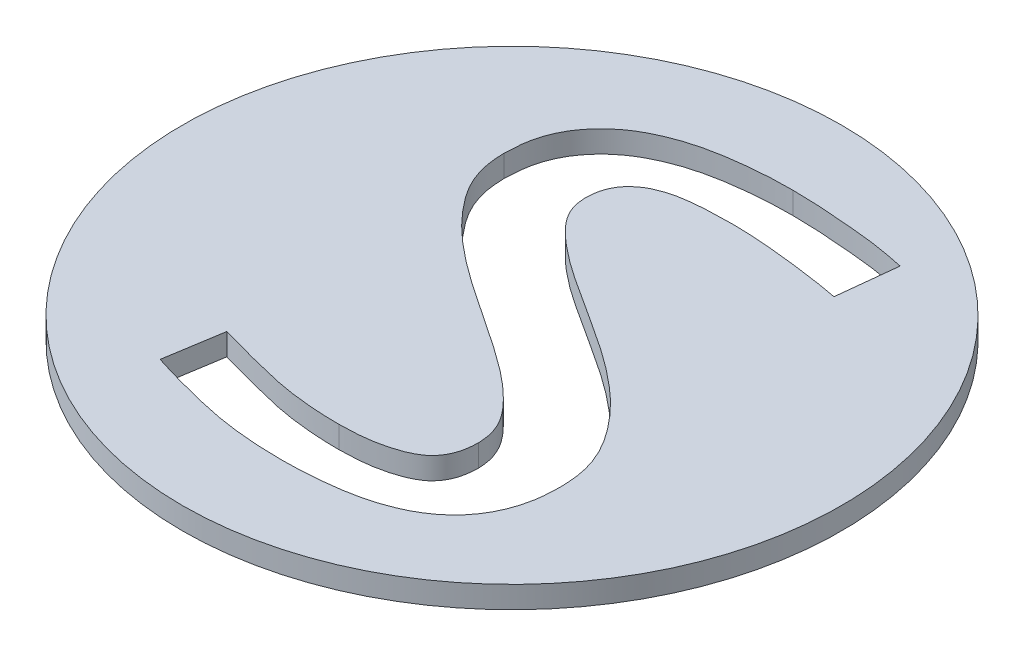
ISO-10303-21;
HEADER;
FILE_DESCRIPTION(('STEP AP214'),'2;1');
FILE_NAME('part.step','',(''),(''),'','','');
FILE_SCHEMA(('AUTOMOTIVE_DESIGN { 1 0 10303 214 1 1 1 1 }'));
ENDSEC;
DATA;
#1=APPLICATION_CONTEXT('core data for automotive mechanical design processes');
#2=APPLICATION_PROTOCOL_DEFINITION('international standard','automotive_design',2000,#1);
#3=PRODUCT_CONTEXT('',#1,'mechanical');
#4=PRODUCT('Part','Part','',(#3));
#5=PRODUCT_RELATED_PRODUCT_CATEGORY('part','',(#4));
#6=PRODUCT_DEFINITION_FORMATION('','',#4);
#7=PRODUCT_DEFINITION_CONTEXT('part definition',#1,'design');
#8=PRODUCT_DEFINITION('design','',#6,#7);
#9=PRODUCT_DEFINITION_SHAPE('','',#8);
#10=(LENGTH_UNIT() NAMED_UNIT(*) SI_UNIT(.MILLI.,.METRE.));
#11=(NAMED_UNIT(*) PLANE_ANGLE_UNIT() SI_UNIT($,.RADIAN.));
#12=(NAMED_UNIT(*) SI_UNIT($,.STERADIAN.) SOLID_ANGLE_UNIT());
#13=UNCERTAINTY_MEASURE_WITH_UNIT(LENGTH_MEASURE(1.E-05),#10,'distance_accuracy_value','');
#14=(GEOMETRIC_REPRESENTATION_CONTEXT(3) GLOBAL_UNCERTAINTY_ASSIGNED_CONTEXT((#13)) GLOBAL_UNIT_ASSIGNED_CONTEXT((#10,
#11,#12)) REPRESENTATION_CONTEXT('',''));
#15=CARTESIAN_POINT('',(0.,0.,0.));
#16=DIRECTION('',(0.,0.,1.));
#17=DIRECTION('',(1.,0.,0.));
#18=AXIS2_PLACEMENT_3D('',#15,#16,#17);
#19=CARTESIAN_POINT('',(0.,3.,0.));
#20=DIRECTION('',(0.,-1.,0.));
#21=DIRECTION('',(0.,0.,-1.));
#22=AXIS2_PLACEMENT_3D('',#19,#20,#21);
#23=CYLINDRICAL_SURFACE('',#22,45.);
#24=CARTESIAN_POINT('',(0.,3.,0.));
#25=DIRECTION('',(0.,1.,0.));
#26=DIRECTION('',(0.,0.,1.));
#27=AXIS2_PLACEMENT_3D('',#24,#25,#26);
#28=CIRCLE('',#27,45.);
#29=CARTESIAN_POINT('',(0.,3.,45.));
#30=VERTEX_POINT('',#29);
#31=EDGE_CURVE('E11',#30,#30,#28,.T.);
#32=ORIENTED_EDGE('',*,*,#31,.F.);
#33=EDGE_LOOP('',(#32));
#34=FACE_BOUND('',#33,.T.);
#35=CARTESIAN_POINT('',(0.,0.,0.));
#36=DIRECTION('',(0.,1.,0.));
#37=DIRECTION('',(0.,0.,1.));
#38=AXIS2_PLACEMENT_3D('',#35,#36,#37);
#39=CIRCLE('',#38,45.);
#40=CARTESIAN_POINT('',(0.,0.,45.));
#41=VERTEX_POINT('',#40);
#42=EDGE_CURVE('E36',#41,#41,#39,.T.);
#43=ORIENTED_EDGE('',*,*,#42,.T.);
#44=EDGE_LOOP('',(#43));
#45=FACE_BOUND('',#44,.T.);
#46=ADVANCED_FACE('F33',(#34,#45),#23,.T.);
#47=CARTESIAN_POINT('',(0.,3.,0.));
#48=DIRECTION('',(0.,1.,0.));
#49=DIRECTION('',(0.,0.,1.));
#50=AXIS2_PLACEMENT_3D('',#47,#48,#49);
#51=PLANE('',#50);
#52=DIRECTION('',(-0.108540378836708,0.,0.994092041091761));
#53=VECTOR('',#52,1.);
#54=CARTESIAN_POINT('',(20.6696628205624,3.,-32.3242306669531));
#55=LINE('',#54,#53);
#56=CARTESIAN_POINT('',(20.6696628205624,3.,-32.3242306669531));
#57=VERTEX_POINT('',#56);
#58=CARTESIAN_POINT('',(19.7809909455624,3.,-24.1851247641753));
#59=VERTEX_POINT('',#58);
#60=EDGE_CURVE('E123',#57,#59,#55,.T.);
#61=ORIENTED_EDGE('',*,*,#60,.T.);
#62=CARTESIAN_POINT('',(19.7809909455624,3.,-24.1851247641753));
#63=CARTESIAN_POINT('',(19.255065106621,3.,-24.2879147975227));
#64=CARTESIAN_POINT('',(18.1220863050278,3.,-24.5093508255225));
#65=CARTESIAN_POINT('',(16.3165516273251,3.,-24.7701799570665));
#66=CARTESIAN_POINT('',(14.3577524177518,3.,-25.0573301276036));
#67=CARTESIAN_POINT('',(12.3110582965966,3.,-25.3028329725789));
#68=CARTESIAN_POINT('',(10.2295676081157,3.,-25.5379302434009));
#69=CARTESIAN_POINT('',(8.17330110133087,3.,-25.6960778815114));
#70=CARTESIAN_POINT('',(6.22191350872532,3.,-25.8192665571809));
#71=CARTESIAN_POINT('',(4.96995689520007,3.,-25.839869106277));
#72=CARTESIAN_POINT('',(4.37734511222905,3.,-25.8496212919531));
#73=B_SPLINE_CURVE_WITH_KNOTS('',3,(#62,#63,#64,#65,#66,#67,#68,#69,#70,#71,#72),.UNSPECIFIED.,
.F.,.F.,(4,1,1,1,1,1,1,1,4),(0.,0.103629530367887,0.223244519345558,0.352755691955491,
0.486535688759644,0.621913482174517,0.757855193409768,0.885381119425096,1.),.UNSPECIFIED.);
#74=CARTESIAN_POINT('',(4.37734511222905,3.,-25.8496212919531));
#75=VERTEX_POINT('',#74);
#76=EDGE_CURVE('E132',#59,#75,#73,.T.);
#77=ORIENTED_EDGE('',*,*,#76,.T.);
#78=CARTESIAN_POINT('',(4.37734511222905,3.,-25.8496212919531));
#79=CARTESIAN_POINT('',(3.44620414552795,3.,-25.839565027623));
#80=CARTESIAN_POINT('',(1.65716033962061,3.,-25.8202434661691));
#81=CARTESIAN_POINT('',(-0.523497458604941,3.,-25.6784224058074));
#82=CARTESIAN_POINT('',(-2.13481450245812,3.,-25.4666213631972));
#83=CARTESIAN_POINT('',(-3.23425872256685,3.,-25.2697433744932));
#84=CARTESIAN_POINT('',(-4.23972254664861,3.,-24.9640518496958));
#85=CARTESIAN_POINT('',(-5.16308949744127,3.,-24.6149936573541));
#86=CARTESIAN_POINT('',(-6.00243157466114,3.,-24.2016604889534));
#87=CARTESIAN_POINT('',(-6.7335068284394,3.,-23.6758956633615));
#88=CARTESIAN_POINT('',(-7.38314189752563,3.,-23.0929977964632));
#89=CARTESIAN_POINT('',(-7.93008105238181,3.,-22.4195432787736));
#90=CARTESIAN_POINT('',(-8.35993509112979,3.,-21.6573677988957));
#91=CARTESIAN_POINT('',(-8.67379089911849,3.,-20.7965887840227));
#92=CARTESIAN_POINT('',(-8.85601585500777,3.,-19.8293573641394));
#93=CARTESIAN_POINT('',(-8.87324058085876,3.,-19.1501149514904));
#94=CARTESIAN_POINT('',(-8.88220349888207,3.,-18.7966699030642));
#95=B_SPLINE_CURVE_WITH_KNOTS('',3,(#78,#79,#80,#81,#82,#83,#84,#85,#86,#87,#88,#89,#90,#91,#92,
#93,#94),.UNSPECIFIED.,.F.,.F.,(4,1,1,1,1,1,1,1,1,1,1,1,1,1,4),(0.,0.163963513888044,
0.31503061234161,0.38434963508013,0.450111434189348,0.511411781908104,0.569070408270717,
0.623870343982577,0.675554642392097,0.727126085606523,0.777166195930033,0.827588401545214,
0.880498222161112,0.937817028399992,1.),.UNSPECIFIED.);
#96=CARTESIAN_POINT('',(-8.88220349888207,3.,-18.7966699030642));
#97=VERTEX_POINT('',#96);
#98=EDGE_CURVE('E47',#75,#97,#95,.T.);
#99=ORIENTED_EDGE('',*,*,#98,.T.);
#100=CARTESIAN_POINT('',(-8.88220349888207,3.,-18.7966699030642));
#101=CARTESIAN_POINT('',(-8.85081802689386,3.,-18.3602025281941));
#102=CARTESIAN_POINT('',(-8.78707682863002,3.,-17.4737747730932));
#103=CARTESIAN_POINT('',(-8.29952928492266,3.,-16.1777732311606));
#104=CARTESIAN_POINT('',(-7.53170587692125,3.,-14.9181747225319));
#105=CARTESIAN_POINT('',(-6.46883597241925,3.,-13.7074308789448));
#106=CARTESIAN_POINT('',(-5.19958807889817,3.,-12.505820488267));
#107=CARTESIAN_POINT('',(-3.75046077875041,3.,-11.3168742836388));
#108=CARTESIAN_POINT('',(-2.1735011640125,3.,-10.0957721064538));
#109=CARTESIAN_POINT('',(0.190472169644528,3.,-8.46546101571294));
#110=CARTESIAN_POINT('',(3.39259114132344,3.,-6.38909708437214));
#111=CARTESIAN_POINT('',(7.4011580744554,3.,-3.8442348700588));
#112=CARTESIAN_POINT('',(11.4369804842133,3.,-1.15443749580354));
#113=CARTESIAN_POINT('',(14.5985471625755,3.,1.33713893179251));
#114=CARTESIAN_POINT('',(16.9411881966374,3.,3.44178261702166));
#115=CARTESIAN_POINT('',(18.5242955409727,3.,5.11661511087057));
#116=CARTESIAN_POINT('',(19.9623891687237,3.,6.86111567916284));
#117=CARTESIAN_POINT('',(21.249269366327,3.,8.67730090538637));
#118=CARTESIAN_POINT('',(22.3007989895631,3.,10.5953601900545));
#119=CARTESIAN_POINT('',(23.0871287291236,3.,12.6234750704734));
#120=CARTESIAN_POINT('',(23.5214822346662,3.,14.7710771684212));
#121=CARTESIAN_POINT('',(23.5854702187873,3.,16.2358875665919));
#122=CARTESIAN_POINT('',(23.6177965011179,3.,16.9758995413803));
#123=B_SPLINE_CURVE_WITH_KNOTS('',3,(#100,#101,#102,#103,#104,#105,#106,#107,#108,#109,#110,
#111,#112,#113,#114,#115,#116,#117,#118,#119,#120,#121,#122),.UNSPECIFIED.,.F.,.F.,(4,1,1,1,1,1,
1,1,1,1,1,1,1,1,1,1,1,1,1,1,4),(0.,0.0259606733975115,0.0527238982009045,0.0815067467710413,
0.113508063298316,0.148386387289986,0.185587818011238,0.225152563899595,0.267203745498686,
0.356650116977245,0.452557527529908,0.55016511702896,0.645514708043951,0.692124152365116,
0.737707515764194,0.782694539326004,0.826765693910883,0.870146532022127,0.91271261683138,
0.955903024122856,1.),.UNSPECIFIED.);
#124=CARTESIAN_POINT('',(23.6177965011179,3.,16.9758995413803));
#125=VERTEX_POINT('',#124);
#126=EDGE_CURVE('E364',#97,#125,#123,.T.);
#127=ORIENTED_EDGE('',*,*,#126,.T.);
#128=CARTESIAN_POINT('',(23.6177965011179,3.,16.9758995413803));
#129=CARTESIAN_POINT('',(23.5997863651037,3.,17.6728254227573));
#130=CARTESIAN_POINT('',(23.5649287961485,3.,19.0216848621095));
#131=CARTESIAN_POINT('',(23.270802133785,3.,20.9655032549888));
#132=CARTESIAN_POINT('',(22.762650282799,3.,22.7485778718377));
#133=CARTESIAN_POINT('',(22.0504835409354,3.,24.3657221397529));
#134=CARTESIAN_POINT('',(21.174041495802,3.,25.835244154121));
#135=CARTESIAN_POINT('',(20.1108882094455,3.,27.1450599997643));
#136=CARTESIAN_POINT('',(18.8974144262097,3.,28.3270962038849));
#137=CARTESIAN_POINT('',(17.5000946896072,3.,29.3366094055421));
#138=CARTESIAN_POINT('',(15.9628831459663,3.,30.2261801670898));
#139=CARTESIAN_POINT('',(14.2586148209261,3.,30.9432497054469));
#140=CARTESIAN_POINT('',(12.4201173949581,3.,31.5753536370026));
#141=CARTESIAN_POINT('',(10.4289459872122,3.,32.0432456846916));
#142=CARTESIAN_POINT('',(8.31567051121279,3.,32.3864309825509));
#143=CARTESIAN_POINT('',(6.09842285081274,3.,32.639222489723));
#144=CARTESIAN_POINT('',(3.77777337992322,3.,32.7973426441367));
#145=CARTESIAN_POINT('',(2.19588809222871,3.,32.8195679738292));
#146=CARTESIAN_POINT('',(1.38689372334016,3.,32.8309342636025));
#147=B_SPLINE_CURVE_WITH_KNOTS('',3,(#128,#129,#130,#131,#132,#133,#134,#135,#136,#137,#138,
#139,#140,#141,#142,#143,#144,#145,#146),.UNSPECIFIED.,.F.,.F.,(4,1,1,1,1,1,1,1,1,1,1,1,1,1,1,1,
4),(0.,0.0671996315078411,0.130060971621876,0.189058384228681,0.245516938984433,
0.300042350781937,0.353591347668707,0.40779893463734,0.462952637346038,0.519433048437115,
0.578748630545945,0.640995038365484,0.706777762838343,0.775747857743539,0.847420812930361,
0.92196924510953,1.),.UNSPECIFIED.);
#148=CARTESIAN_POINT('',(1.38689372334016,3.,32.8309342636025));
#149=VERTEX_POINT('',#148);
#150=EDGE_CURVE('E345',#125,#149,#147,.T.);
#151=ORIENTED_EDGE('',*,*,#150,.T.);
#152=CARTESIAN_POINT('',(1.38689372334016,3.,32.8309342636025));
#153=CARTESIAN_POINT('',(0.384854834825532,3.,32.8195679285104));
#154=CARTESIAN_POINT('',(-1.57956541329445,3.,32.7972851019079));
#155=CARTESIAN_POINT('',(-4.46968904267124,3.,32.5577807834037));
#156=CARTESIAN_POINT('',(-7.24679105813057,3.,32.2075776433812));
#157=CARTESIAN_POINT('',(-9.88500537795048,3.,31.6702726485862));
#158=CARTESIAN_POINT('',(-12.3686067417714,3.,31.076733401809));
#159=CARTESIAN_POINT('',(-14.6810000891842,3.,30.469055858665));
#160=CARTESIAN_POINT('',(-16.8133871045664,3.,29.8684091537282));
#161=CARTESIAN_POINT('',(-18.1649155033988,3.,29.4395155346011));
#162=CARTESIAN_POINT('',(-18.8127590544376,3.,29.2339290552691));
#163=B_SPLINE_CURVE_WITH_KNOTS('',3,(#152,#153,#154,#155,#156,#157,#158,#159,#160,#161,#162),
.UNSPECIFIED.,.F.,.F.,(4,1,1,1,1,1,1,1,4),(0.,0.145830170071183,0.285888843395354,
0.421896772131473,0.553043691279081,0.677557129415647,0.793602898763449,0.901065319008679,1.),.UNSPECIFIED.);
#164=CARTESIAN_POINT('',(-18.8127590544376,3.,29.2339290552691));
#165=VERTEX_POINT('',#164);
#166=EDGE_CURVE('E339',#149,#165,#163,.T.);
#167=ORIENTED_EDGE('',*,*,#166,.T.);
#168=DIRECTION('',(0.158059765633068,0.,-0.987429547100966));
#169=VECTOR('',#168,1.);
#170=CARTESIAN_POINT('',(-18.8127590544376,3.,29.2339290552691));
#171=LINE('',#170,#169);
#172=CARTESIAN_POINT('',(-17.5573337072154,3.,21.3910471108247));
#173=VERTEX_POINT('',#172);
#174=EDGE_CURVE('E333',#165,#173,#171,.T.);
#175=ORIENTED_EDGE('',*,*,#174,.T.);
#176=CARTESIAN_POINT('',(-17.5573337072154,3.,21.3910471108247));
#177=CARTESIAN_POINT('',(-16.9276502298919,3.,21.5710662268897));
#178=CARTESIAN_POINT('',(-15.6235090083726,3.,21.943904896438));
#179=CARTESIAN_POINT('',(-13.5979877843475,3.,22.4940449752685));
#180=CARTESIAN_POINT('',(-11.4280217875366,3.,23.0404224461487));
#181=CARTESIAN_POINT('',(-9.13728073418422,3.,23.6133616789587));
#182=CARTESIAN_POINT('',(-6.72469763034584,3.,24.1216153168747));
#183=CARTESIAN_POINT('',(-4.2057202453163,3.,24.4437577138751));
#184=CARTESIAN_POINT('',(-1.6029426903464,3.,24.6688641109388));
#185=CARTESIAN_POINT('',(0.163871673224171,3.,24.6934368063011));
#186=CARTESIAN_POINT('',(1.06245795945127,3.,24.7059342636025));
#187=B_SPLINE_CURVE_WITH_KNOTS('',3,(#176,#177,#178,#179,#180,#181,#182,#183,#184,#185,#186),
.UNSPECIFIED.,.F.,.F.,(4,1,1,1,1,1,1,1,4),(0.,0.103481153785074,0.214320437428516,
0.331626791409147,0.457042619033111,0.587449106869461,0.720891118065015,0.858047671084073,1.),.UNSPECIFIED.);
#188=CARTESIAN_POINT('',(1.06245795945127,3.,24.7059342636025));
#189=VERTEX_POINT('',#188);
#190=EDGE_CURVE('E324',#173,#189,#187,.T.);
#191=ORIENTED_EDGE('',*,*,#190,.T.);
#192=CARTESIAN_POINT('',(1.06245795945127,3.,24.7059342636025));
#193=CARTESIAN_POINT('',(1.87665063655184,3.,24.6872468074422));
#194=CARTESIAN_POINT('',(3.43509711364215,3.,24.6514771413204));
#195=CARTESIAN_POINT('',(5.66370868120045,3.,24.3752530869478));
#196=CARTESIAN_POINT('',(7.66548933978184,3.,23.896733065921));
#197=CARTESIAN_POINT('',(9.18558476316509,3.,23.3451515338888));
#198=CARTESIAN_POINT('',(10.2417149801713,3.,22.7537094023037));
#199=CARTESIAN_POINT('',(10.9373167170578,3.,22.2487850463561));
#200=CARTESIAN_POINT('',(11.499265321224,3.,21.6292577427363));
#201=CARTESIAN_POINT('',(11.9790431628167,3.,20.9414284671759));
#202=CARTESIAN_POINT('',(12.3427768910657,3.,20.1633572494996));
#203=CARTESIAN_POINT('',(12.5968854985326,3.,19.2976503422508));
#204=CARTESIAN_POINT('',(12.7511368923556,3.,18.3543555080202));
#205=CARTESIAN_POINT('',(12.7731337181019,3.,17.6958973362352));
#206=CARTESIAN_POINT('',(12.7844631677846,3.,17.3567589163803));
#207=B_SPLINE_CURVE_WITH_KNOTS('',3,(#192,#193,#194,#195,#196,#197,#198,#199,#200,#201,#202,
#203,#204,#205,#206),.UNSPECIFIED.,.F.,.F.,(4,1,1,1,1,1,1,1,1,1,1,1,4),(0.,0.155430416051513,
0.297509411642917,0.427714088890579,0.547916371668915,0.604592911612844,0.658455340320675,
0.711176053806221,0.76346701340531,0.818079785869876,0.874313812372286,0.93526541715763,1.),.UNSPECIFIED.);
#208=CARTESIAN_POINT('',(12.7844631677846,3.,17.3567589163803));
#209=VERTEX_POINT('',#208);
#210=EDGE_CURVE('E291',#189,#209,#207,.T.);
#211=ORIENTED_EDGE('',*,*,#210,.T.);
#212=CARTESIAN_POINT('',(12.7844631677846,3.,17.3567589163803));
#213=CARTESIAN_POINT('',(12.7523734178541,3.,16.8599174271559));
#214=CARTESIAN_POINT('',(12.6878801969326,3.,15.8613771456967));
#215=CARTESIAN_POINT('',(12.2242044593129,3.,14.3884684509333));
#216=CARTESIAN_POINT('',(11.4624653573504,3.,12.96429208651));
#217=CARTESIAN_POINT('',(10.3909251544765,3.,11.6055312098072));
#218=CARTESIAN_POINT('',(9.12441486904445,3.,10.2678419990847));
#219=CARTESIAN_POINT('',(7.68611871835446,3.,8.93659787201523));
#220=CARTESIAN_POINT('',(6.09522796876932,3.,7.61255993901226));
#221=CARTESIAN_POINT('',(3.71757154601949,3.,5.854064759928));
#222=CARTESIAN_POINT('',(0.528855770434476,3.,3.6357429075876));
#223=CARTESIAN_POINT('',(-3.48971357311284,3.,1.0253766338524));
#224=CARTESIAN_POINT('',(-7.50536886349634,3.,-1.69739527564761));
#225=CARTESIAN_POINT('',(-10.6966393382449,3.,-4.11977157814966));
#226=CARTESIAN_POINT('',(-13.0431620375687,3.,-6.16845415199043));
#227=CARTESIAN_POINT('',(-14.6377708321447,3.,-7.74065426492729));
#228=CARTESIAN_POINT('',(-16.0640772116833,3.,-9.37216610116726));
#229=CARTESIAN_POINT('',(-17.3484526088425,3.,-11.025867113004));
#230=CARTESIAN_POINT('',(-18.4218096395584,3.,-12.7663477838999));
#231=CARTESIAN_POINT('',(-19.1688626708049,3.,-14.6256428089067));
#232=CARTESIAN_POINT('',(-19.6245366028847,3.,-16.5837636902629));
#233=CARTESIAN_POINT('',(-19.6848542049699,3.,-17.9196451276896));
#234=CARTESIAN_POINT('',(-19.7155368322154,3.,-18.5991872641753));
#235=B_SPLINE_CURVE_WITH_KNOTS('',3,(#212,#213,#214,#215,#216,#217,#218,#219,#220,#221,#222,
#223,#224,#225,#226,#227,#228,#229,#230,#231,#232,#233,#234),.UNSPECIFIED.,.F.,.F.,(4,1,1,1,1,1,
1,1,1,1,1,1,1,1,1,1,1,1,1,1,4),(0.,0.0295690332875715,0.0594271441935082,0.0911253893288085,
0.125295943827843,0.162151366430598,0.200794902694756,0.241962426201424,0.285374377287542,
0.376901329359568,0.473301980668103,0.570798586549207,0.665864033667757,0.711708643280979,
0.756269077728772,0.799136431622499,0.840701232666101,0.880904737583079,0.920483903639601,
0.95955139693397,1.),.UNSPECIFIED.);
#236=CARTESIAN_POINT('',(-19.7155368322154,3.,-18.5991872641753));
#237=VERTEX_POINT('',#236);
#238=EDGE_CURVE('E289',#209,#237,#235,.T.);
#239=ORIENTED_EDGE('',*,*,#238,.T.);
#240=CARTESIAN_POINT('',(-19.7155368322154,3.,-18.5991872641753));
#241=CARTESIAN_POINT('',(-19.690075720197,3.,-19.2964311025447));
#242=CARTESIAN_POINT('',(-19.6408697580164,3.,-20.6439195357544));
#243=CARTESIAN_POINT('',(-19.2945313684999,3.,-22.5820841594816));
#244=CARTESIAN_POINT('',(-18.6791445462542,3.,-24.3382327412342));
#245=CARTESIAN_POINT('',(-17.8428695625012,3.,-25.9236637043012));
#246=CARTESIAN_POINT('',(-16.7791107411905,3.,-27.3263212858442));
#247=CARTESIAN_POINT('',(-15.5586225338388,3.,-28.5868813960315));
#248=CARTESIAN_POINT('',(-14.1822830579992,3.,-29.7143513921869));
#249=CARTESIAN_POINT('',(-12.6237899189574,3.,-30.6732688512133));
#250=CARTESIAN_POINT('',(-10.9179688211663,3.,-31.4968465454517));
#251=CARTESIAN_POINT('',(-9.06947659485161,3.,-32.2084144749823));
#252=CARTESIAN_POINT('',(-7.08100280325103,3.,-32.779480609287));
#253=CARTESIAN_POINT('',(-4.95851507425524,3.,-33.2271402134033));
#254=CARTESIAN_POINT('',(-2.7337525090271,3.,-33.5564209423475));
#255=CARTESIAN_POINT('',(-0.42242836684341,3.,-33.7915011199192));
#256=CARTESIAN_POINT('',(1.95338712046191,3.,-33.9585398738402));
#257=CARTESIAN_POINT('',(3.56360831890447,3.,-33.969222666378));
#258=CARTESIAN_POINT('',(4.37734511222905,3.,-33.9746212919531));
#259=B_SPLINE_CURVE_WITH_KNOTS('',3,(#240,#241,#242,#243,#244,#245,#246,#247,#248,#249,#250,
#251,#252,#253,#254,#255,#256,#257,#258),.UNSPECIFIED.,.F.,.F.,(4,1,1,1,1,1,1,1,1,1,1,1,1,1,1,1,
4),(0.,0.0648990443948748,0.125423426979262,0.182455391525773,0.237476723007676,
0.29157632953194,0.345746714665033,0.400502780633735,0.456734690144947,0.515656778384569,
0.576621126186782,0.640892796694439,0.708024961561982,0.778407371751462,0.850139200312799,
0.924266773595783,1.),.UNSPECIFIED.);
#260=CARTESIAN_POINT('',(4.37734511222905,3.,-33.9746212919531));
#261=VERTEX_POINT('',#260);
#262=EDGE_CURVE('E284',#237,#261,#259,.T.);
#263=ORIENTED_EDGE('',*,*,#262,.T.);
#264=CARTESIAN_POINT('',(4.37734511222905,3.,-33.9746212919531));
#265=CARTESIAN_POINT('',(5.11098912571531,3.,-33.9652543510986));
#266=CARTESIAN_POINT('',(6.60728161250916,3.,-33.9461501493781));
#267=CARTESIAN_POINT('',(8.86948145757873,3.,-33.8277227085934));
#268=CARTESIAN_POINT('',(11.1401417697892,3.,-33.657276118422));
#269=CARTESIAN_POINT('',(13.3549310433015,3.,-33.4600727587755));
#270=CARTESIAN_POINT('',(15.4510662997225,3.,-33.2505324731469));
#271=CARTESIAN_POINT('',(17.3781365043471,3.,-32.9633986748456));
#272=CARTESIAN_POINT('',(19.0992761850766,3.,-32.6590525204164));
#273=CARTESIAN_POINT('',(20.1717904980976,3.,-32.43038193571));
#274=CARTESIAN_POINT('',(20.6696628205624,3.,-32.3242306669531));
#275=B_SPLINE_CURVE_WITH_KNOTS('',3,(#264,#265,#266,#267,#268,#269,#270,#271,#272,#273,#274),
.UNSPECIFIED.,.F.,.F.,(4,1,1,1,1,1,1,1,4),(0.,0.134183682005266,0.273672287300105,
0.41423047450975,0.550641707271928,0.68037241217382,0.799440271040173,0.9068980834681,1.),.UNSPECIFIED.);
#276=EDGE_CURVE('E129',#261,#57,#275,.T.);
#277=ORIENTED_EDGE('',*,*,#276,.T.);
#278=EDGE_LOOP('',(#61,#77,#99,#127,#151,#167,#175,#191,#211,#239,#263,#277));
#279=FACE_BOUND('',#278,.T.);
#280=ORIENTED_EDGE('',*,*,#31,.T.);
#281=EDGE_LOOP('',(#280));
#282=FACE_BOUND('',#281,.T.);
#283=ADVANCED_FACE('F136',(#279,#282),#51,.T.);
#284=CARTESIAN_POINT('',(0.,0.,0.));
#285=DIRECTION('',(0.,1.,0.));
#286=DIRECTION('',(0.,0.,1.));
#287=AXIS2_PLACEMENT_3D('',#284,#285,#286);
#288=PLANE('',#287);
#289=CARTESIAN_POINT('',(19.7809909455624,0.,-24.1851247641753));
#290=CARTESIAN_POINT('',(19.255065106621,0.,-24.2879147975227));
#291=CARTESIAN_POINT('',(18.1220863050278,0.,-24.5093508255225));
#292=CARTESIAN_POINT('',(16.3165516273251,0.,-24.7701799570665));
#293=CARTESIAN_POINT('',(14.3577524177518,0.,-25.0573301276036));
#294=CARTESIAN_POINT('',(12.3110582965966,0.,-25.3028329725789));
#295=CARTESIAN_POINT('',(10.2295676081157,0.,-25.5379302434009));
#296=CARTESIAN_POINT('',(8.17330110133087,0.,-25.6960778815114));
#297=CARTESIAN_POINT('',(6.22191350872532,0.,-25.8192665571809));
#298=CARTESIAN_POINT('',(4.96995689520007,0.,-25.839869106277));
#299=CARTESIAN_POINT('',(4.37734511222905,0.,-25.8496212919531));
#300=B_SPLINE_CURVE_WITH_KNOTS('',3,(#289,#290,#291,#292,#293,#294,#295,#296,#297,#298,#299),
.UNSPECIFIED.,.F.,.F.,(4,1,1,1,1,1,1,1,4),(0.,0.103629530367887,0.223244519345558,
0.352755691955491,0.486535688759644,0.621913482174517,0.757855193409768,0.885381119425096,1.),.UNSPECIFIED.);
#301=CARTESIAN_POINT('',(19.7809909455624,0.,-24.1851247641753));
#302=VERTEX_POINT('',#301);
#303=CARTESIAN_POINT('',(4.37734511222905,0.,-25.8496212919531));
#304=VERTEX_POINT('',#303);
#305=EDGE_CURVE('E208',#302,#304,#300,.T.);
#306=ORIENTED_EDGE('',*,*,#305,.F.);
#307=DIRECTION('',(-0.108540378836708,0.,0.994092041091761));
#308=VECTOR('',#307,1.);
#309=CARTESIAN_POINT('',(20.6696628205624,0.,-32.3242306669531));
#310=LINE('',#309,#308);
#311=CARTESIAN_POINT('',(20.6696628205624,0.,-32.3242306669531));
#312=VERTEX_POINT('',#311);
#313=EDGE_CURVE('E55',#312,#302,#310,.T.);
#314=ORIENTED_EDGE('',*,*,#313,.F.);
#315=CARTESIAN_POINT('',(4.37734511222905,0.,-33.9746212919531));
#316=CARTESIAN_POINT('',(5.11098912571531,0.,-33.9652543510986));
#317=CARTESIAN_POINT('',(6.60728161250916,0.,-33.9461501493781));
#318=CARTESIAN_POINT('',(8.86948145757873,0.,-33.8277227085934));
#319=CARTESIAN_POINT('',(11.1401417697892,0.,-33.657276118422));
#320=CARTESIAN_POINT('',(13.3549310433015,0.,-33.4600727587755));
#321=CARTESIAN_POINT('',(15.4510662997225,0.,-33.2505324731469));
#322=CARTESIAN_POINT('',(17.3781365043471,0.,-32.9633986748456));
#323=CARTESIAN_POINT('',(19.0992761850766,0.,-32.6590525204164));
#324=CARTESIAN_POINT('',(20.1717904980976,0.,-32.43038193571));
#325=CARTESIAN_POINT('',(20.6696628205624,0.,-32.3242306669531));
#326=B_SPLINE_CURVE_WITH_KNOTS('',3,(#315,#316,#317,#318,#319,#320,#321,#322,#323,#324,#325),
.UNSPECIFIED.,.F.,.F.,(4,1,1,1,1,1,1,1,4),(0.,0.134183682005266,0.273672287300105,
0.41423047450975,0.550641707271928,0.68037241217382,0.799440271040173,0.9068980834681,1.),.UNSPECIFIED.);
#327=CARTESIAN_POINT('',(4.37734511222905,0.,-33.9746212919531));
#328=VERTEX_POINT('',#327);
#329=EDGE_CURVE('E140',#328,#312,#326,.T.);
#330=ORIENTED_EDGE('',*,*,#329,.F.);
#331=CARTESIAN_POINT('',(-19.7155368322154,0.,-18.5991872641753));
#332=CARTESIAN_POINT('',(-19.690075720197,0.,-19.2964311025447));
#333=CARTESIAN_POINT('',(-19.6408697580164,0.,-20.6439195357544));
#334=CARTESIAN_POINT('',(-19.2945313684999,0.,-22.5820841594816));
#335=CARTESIAN_POINT('',(-18.6791445462542,0.,-24.3382327412342));
#336=CARTESIAN_POINT('',(-17.8428695625012,0.,-25.9236637043012));
#337=CARTESIAN_POINT('',(-16.7791107411905,0.,-27.3263212858442));
#338=CARTESIAN_POINT('',(-15.5586225338388,0.,-28.5868813960315));
#339=CARTESIAN_POINT('',(-14.1822830579992,0.,-29.7143513921869));
#340=CARTESIAN_POINT('',(-12.6237899189574,0.,-30.6732688512133));
#341=CARTESIAN_POINT('',(-10.9179688211663,0.,-31.4968465454517));
#342=CARTESIAN_POINT('',(-9.06947659485161,0.,-32.2084144749823));
#343=CARTESIAN_POINT('',(-7.08100280325103,0.,-32.779480609287));
#344=CARTESIAN_POINT('',(-4.95851507425524,0.,-33.2271402134033));
#345=CARTESIAN_POINT('',(-2.7337525090271,0.,-33.5564209423475));
#346=CARTESIAN_POINT('',(-0.42242836684341,0.,-33.7915011199192));
#347=CARTESIAN_POINT('',(1.95338712046191,0.,-33.9585398738402));
#348=CARTESIAN_POINT('',(3.56360831890447,0.,-33.969222666378));
#349=CARTESIAN_POINT('',(4.37734511222905,0.,-33.9746212919531));
#350=B_SPLINE_CURVE_WITH_KNOTS('',3,(#331,#332,#333,#334,#335,#336,#337,#338,#339,#340,#341,
#342,#343,#344,#345,#346,#347,#348,#349),.UNSPECIFIED.,.F.,.F.,(4,1,1,1,1,1,1,1,1,1,1,1,1,1,1,1,
4),(0.,0.0648990443948748,0.125423426979262,0.182455391525773,0.237476723007676,
0.29157632953194,0.345746714665033,0.400502780633735,0.456734690144947,0.515656778384569,
0.576621126186782,0.640892796694439,0.708024961561982,0.778407371751462,0.850139200312799,
0.924266773595783,1.),.UNSPECIFIED.);
#351=CARTESIAN_POINT('',(-19.7155368322154,0.,-18.5991872641753));
#352=VERTEX_POINT('',#351);
#353=EDGE_CURVE('E143',#352,#328,#350,.T.);
#354=ORIENTED_EDGE('',*,*,#353,.F.);
#355=CARTESIAN_POINT('',(12.7844631677846,0.,17.3567589163803));
#356=CARTESIAN_POINT('',(12.7523734178541,0.,16.8599174271559));
#357=CARTESIAN_POINT('',(12.6878801969326,0.,15.8613771456967));
#358=CARTESIAN_POINT('',(12.2242044593129,0.,14.3884684509333));
#359=CARTESIAN_POINT('',(11.4624653573504,0.,12.96429208651));
#360=CARTESIAN_POINT('',(10.3909251544765,0.,11.6055312098072));
#361=CARTESIAN_POINT('',(9.12441486904445,0.,10.2678419990847));
#362=CARTESIAN_POINT('',(7.68611871835446,0.,8.93659787201523));
#363=CARTESIAN_POINT('',(6.09522796876932,0.,7.61255993901226));
#364=CARTESIAN_POINT('',(3.71757154601949,0.,5.854064759928));
#365=CARTESIAN_POINT('',(0.528855770434476,0.,3.6357429075876));
#366=CARTESIAN_POINT('',(-3.48971357311284,0.,1.0253766338524));
#367=CARTESIAN_POINT('',(-7.50536886349634,0.,-1.69739527564761));
#368=CARTESIAN_POINT('',(-10.6966393382449,0.,-4.11977157814966));
#369=CARTESIAN_POINT('',(-13.0431620375687,0.,-6.16845415199043));
#370=CARTESIAN_POINT('',(-14.6377708321447,0.,-7.74065426492729));
#371=CARTESIAN_POINT('',(-16.0640772116833,0.,-9.37216610116726));
#372=CARTESIAN_POINT('',(-17.3484526088425,0.,-11.025867113004));
#373=CARTESIAN_POINT('',(-18.4218096395584,0.,-12.7663477838999));
#374=CARTESIAN_POINT('',(-19.1688626708049,0.,-14.6256428089067));
#375=CARTESIAN_POINT('',(-19.6245366028847,0.,-16.5837636902629));
#376=CARTESIAN_POINT('',(-19.6848542049699,0.,-17.9196451276896));
#377=CARTESIAN_POINT('',(-19.7155368322154,0.,-18.5991872641753));
#378=B_SPLINE_CURVE_WITH_KNOTS('',3,(#355,#356,#357,#358,#359,#360,#361,#362,#363,#364,#365,
#366,#367,#368,#369,#370,#371,#372,#373,#374,#375,#376,#377),.UNSPECIFIED.,.F.,.F.,(4,1,1,1,1,1,
1,1,1,1,1,1,1,1,1,1,1,1,1,1,4),(0.,0.0295690332875715,0.0594271441935082,0.0911253893288085,
0.125295943827843,0.162151366430598,0.200794902694756,0.241962426201424,0.285374377287542,
0.376901329359568,0.473301980668103,0.570798586549207,0.665864033667757,0.711708643280979,
0.756269077728772,0.799136431622499,0.840701232666101,0.880904737583079,0.920483903639601,
0.95955139693397,1.),.UNSPECIFIED.);
#379=CARTESIAN_POINT('',(12.7844631677846,0.,17.3567589163803));
#380=VERTEX_POINT('',#379);
#381=EDGE_CURVE('E261',#380,#352,#378,.T.);
#382=ORIENTED_EDGE('',*,*,#381,.F.);
#383=CARTESIAN_POINT('',(1.06245795945127,0.,24.7059342636025));
#384=CARTESIAN_POINT('',(1.87665063655184,0.,24.6872468074422));
#385=CARTESIAN_POINT('',(3.43509711364215,0.,24.6514771413204));
#386=CARTESIAN_POINT('',(5.66370868120045,0.,24.3752530869478));
#387=CARTESIAN_POINT('',(7.66548933978184,0.,23.896733065921));
#388=CARTESIAN_POINT('',(9.18558476316509,0.,23.3451515338888));
#389=CARTESIAN_POINT('',(10.2417149801713,0.,22.7537094023037));
#390=CARTESIAN_POINT('',(10.9373167170578,0.,22.2487850463561));
#391=CARTESIAN_POINT('',(11.499265321224,0.,21.6292577427363));
#392=CARTESIAN_POINT('',(11.9790431628167,0.,20.9414284671759));
#393=CARTESIAN_POINT('',(12.3427768910657,0.,20.1633572494996));
#394=CARTESIAN_POINT('',(12.5968854985326,0.,19.2976503422508));
#395=CARTESIAN_POINT('',(12.7511368923556,0.,18.3543555080202));
#396=CARTESIAN_POINT('',(12.7731337181019,0.,17.6958973362352));
#397=CARTESIAN_POINT('',(12.7844631677846,0.,17.3567589163803));
#398=B_SPLINE_CURVE_WITH_KNOTS('',3,(#383,#384,#385,#386,#387,#388,#389,#390,#391,#392,#393,
#394,#395,#396,#397),.UNSPECIFIED.,.F.,.F.,(4,1,1,1,1,1,1,1,1,1,1,1,4),(0.,0.155430416051513,
0.297509411642917,0.427714088890579,0.547916371668915,0.604592911612844,0.658455340320675,
0.711176053806221,0.76346701340531,0.818079785869876,0.874313812372286,0.93526541715763,1.),.UNSPECIFIED.);
#399=CARTESIAN_POINT('',(1.06245795945127,0.,24.7059342636025));
#400=VERTEX_POINT('',#399);
#401=EDGE_CURVE('E253',#400,#380,#398,.T.);
#402=ORIENTED_EDGE('',*,*,#401,.F.);
#403=CARTESIAN_POINT('',(-17.5573337072154,0.,21.3910471108247));
#404=CARTESIAN_POINT('',(-16.9276502298919,0.,21.5710662268897));
#405=CARTESIAN_POINT('',(-15.6235090083726,0.,21.943904896438));
#406=CARTESIAN_POINT('',(-13.5979877843475,0.,22.4940449752685));
#407=CARTESIAN_POINT('',(-11.4280217875366,0.,23.0404224461487));
#408=CARTESIAN_POINT('',(-9.13728073418422,0.,23.6133616789587));
#409=CARTESIAN_POINT('',(-6.72469763034584,0.,24.1216153168747));
#410=CARTESIAN_POINT('',(-4.2057202453163,0.,24.4437577138751));
#411=CARTESIAN_POINT('',(-1.6029426903464,0.,24.6688641109388));
#412=CARTESIAN_POINT('',(0.163871673224171,0.,24.6934368063011));
#413=CARTESIAN_POINT('',(1.06245795945127,0.,24.7059342636025));
#414=B_SPLINE_CURVE_WITH_KNOTS('',3,(#403,#404,#405,#406,#407,#408,#409,#410,#411,#412,#413),
.UNSPECIFIED.,.F.,.F.,(4,1,1,1,1,1,1,1,4),(0.,0.103481153785074,0.214320437428516,
0.331626791409147,0.457042619033111,0.587449106869461,0.720891118065015,0.858047671084073,1.),.UNSPECIFIED.);
#415=CARTESIAN_POINT('',(-17.5573337072154,0.,21.3910471108247));
#416=VERTEX_POINT('',#415);
#417=EDGE_CURVE('E248',#416,#400,#414,.T.);
#418=ORIENTED_EDGE('',*,*,#417,.F.);
#419=DIRECTION('',(0.158059765633068,0.,-0.987429547100966));
#420=VECTOR('',#419,1.);
#421=CARTESIAN_POINT('',(-18.8127590544376,0.,29.2339290552691));
#422=LINE('',#421,#420);
#423=CARTESIAN_POINT('',(-18.8127590544376,0.,29.2339290552691));
#424=VERTEX_POINT('',#423);
#425=EDGE_CURVE('E242',#424,#416,#422,.T.);
#426=ORIENTED_EDGE('',*,*,#425,.F.);
#427=CARTESIAN_POINT('',(1.38689372334016,0.,32.8309342636025));
#428=CARTESIAN_POINT('',(0.384854834825532,0.,32.8195679285104));
#429=CARTESIAN_POINT('',(-1.57956541329445,0.,32.7972851019079));
#430=CARTESIAN_POINT('',(-4.46968904267124,0.,32.5577807834037));
#431=CARTESIAN_POINT('',(-7.24679105813057,0.,32.2075776433812));
#432=CARTESIAN_POINT('',(-9.88500537795048,0.,31.6702726485862));
#433=CARTESIAN_POINT('',(-12.3686067417714,0.,31.076733401809));
#434=CARTESIAN_POINT('',(-14.6810000891842,0.,30.469055858665));
#435=CARTESIAN_POINT('',(-16.8133871045664,0.,29.8684091537282));
#436=CARTESIAN_POINT('',(-18.1649155033988,0.,29.4395155346011));
#437=CARTESIAN_POINT('',(-18.8127590544376,0.,29.2339290552691));
#438=B_SPLINE_CURVE_WITH_KNOTS('',3,(#427,#428,#429,#430,#431,#432,#433,#434,#435,#436,#437),
.UNSPECIFIED.,.F.,.F.,(4,1,1,1,1,1,1,1,4),(0.,0.145830170071183,0.285888843395354,
0.421896772131473,0.553043691279081,0.677557129415647,0.793602898763449,0.901065319008679,1.),.UNSPECIFIED.);
#439=CARTESIAN_POINT('',(1.38689372334016,0.,32.8309342636025));
#440=VERTEX_POINT('',#439);
#441=EDGE_CURVE('E234',#440,#424,#438,.T.);
#442=ORIENTED_EDGE('',*,*,#441,.F.);
#443=CARTESIAN_POINT('',(23.6177965011179,0.,16.9758995413803));
#444=CARTESIAN_POINT('',(23.5997863651037,0.,17.6728254227573));
#445=CARTESIAN_POINT('',(23.5649287961485,0.,19.0216848621095));
#446=CARTESIAN_POINT('',(23.270802133785,0.,20.9655032549888));
#447=CARTESIAN_POINT('',(22.762650282799,0.,22.7485778718377));
#448=CARTESIAN_POINT('',(22.0504835409354,0.,24.3657221397529));
#449=CARTESIAN_POINT('',(21.174041495802,0.,25.835244154121));
#450=CARTESIAN_POINT('',(20.1108882094455,0.,27.1450599997643));
#451=CARTESIAN_POINT('',(18.8974144262097,0.,28.3270962038849));
#452=CARTESIAN_POINT('',(17.5000946896072,0.,29.3366094055421));
#453=CARTESIAN_POINT('',(15.9628831459663,0.,30.2261801670898));
#454=CARTESIAN_POINT('',(14.2586148209261,0.,30.9432497054469));
#455=CARTESIAN_POINT('',(12.4201173949581,0.,31.5753536370026));
#456=CARTESIAN_POINT('',(10.4289459872122,0.,32.0432456846916));
#457=CARTESIAN_POINT('',(8.31567051121279,0.,32.3864309825509));
#458=CARTESIAN_POINT('',(6.09842285081274,0.,32.639222489723));
#459=CARTESIAN_POINT('',(3.77777337992322,0.,32.7973426441367));
#460=CARTESIAN_POINT('',(2.19588809222871,0.,32.8195679738292));
#461=CARTESIAN_POINT('',(1.38689372334016,0.,32.8309342636025));
#462=B_SPLINE_CURVE_WITH_KNOTS('',3,(#443,#444,#445,#446,#447,#448,#449,#450,#451,#452,#453,
#454,#455,#456,#457,#458,#459,#460,#461),.UNSPECIFIED.,.F.,.F.,(4,1,1,1,1,1,1,1,1,1,1,1,1,1,1,1,
4),(0.,0.0671996315078411,0.130060971621876,0.189058384228681,0.245516938984433,
0.300042350781937,0.353591347668707,0.40779893463734,0.462952637346038,0.519433048437115,
0.578748630545945,0.640995038365484,0.706777762838343,0.775747857743539,0.847420812930361,
0.92196924510953,1.),.UNSPECIFIED.);
#463=CARTESIAN_POINT('',(23.6177965011179,0.,16.9758995413803));
#464=VERTEX_POINT('',#463);
#465=EDGE_CURVE('E214',#464,#440,#462,.T.);
#466=ORIENTED_EDGE('',*,*,#465,.F.);
#467=CARTESIAN_POINT('',(-8.88220349888207,0.,-18.7966699030642));
#468=CARTESIAN_POINT('',(-8.85081802689386,0.,-18.3602025281941));
#469=CARTESIAN_POINT('',(-8.78707682863002,0.,-17.4737747730932));
#470=CARTESIAN_POINT('',(-8.29952928492266,0.,-16.1777732311606));
#471=CARTESIAN_POINT('',(-7.53170587692125,0.,-14.9181747225319));
#472=CARTESIAN_POINT('',(-6.46883597241925,0.,-13.7074308789448));
#473=CARTESIAN_POINT('',(-5.19958807889817,0.,-12.505820488267));
#474=CARTESIAN_POINT('',(-3.75046077875041,0.,-11.3168742836388));
#475=CARTESIAN_POINT('',(-2.1735011640125,0.,-10.0957721064538));
#476=CARTESIAN_POINT('',(0.190472169644528,0.,-8.46546101571294));
#477=CARTESIAN_POINT('',(3.39259114132344,0.,-6.38909708437214));
#478=CARTESIAN_POINT('',(7.4011580744554,0.,-3.8442348700588));
#479=CARTESIAN_POINT('',(11.4369804842133,0.,-1.15443749580354));
#480=CARTESIAN_POINT('',(14.5985471625755,0.,1.33713893179251));
#481=CARTESIAN_POINT('',(16.9411881966374,0.,3.44178261702166));
#482=CARTESIAN_POINT('',(18.5242955409727,0.,5.11661511087057));
#483=CARTESIAN_POINT('',(19.9623891687237,0.,6.86111567916284));
#484=CARTESIAN_POINT('',(21.249269366327,0.,8.67730090538637));
#485=CARTESIAN_POINT('',(22.3007989895631,0.,10.5953601900545));
#486=CARTESIAN_POINT('',(23.0871287291236,0.,12.6234750704734));
#487=CARTESIAN_POINT('',(23.5214822346662,0.,14.7710771684212));
#488=CARTESIAN_POINT('',(23.5854702187873,0.,16.2358875665919));
#489=CARTESIAN_POINT('',(23.6177965011179,0.,16.9758995413803));
#490=B_SPLINE_CURVE_WITH_KNOTS('',3,(#467,#468,#469,#470,#471,#472,#473,#474,#475,#476,#477,
#478,#479,#480,#481,#482,#483,#484,#485,#486,#487,#488,#489),.UNSPECIFIED.,.F.,.F.,(4,1,1,1,1,1,
1,1,1,1,1,1,1,1,1,1,1,1,1,1,4),(0.,0.0259606733975115,0.0527238982009045,0.0815067467710413,
0.113508063298316,0.148386387289986,0.185587818011238,0.225152563899595,0.267203745498686,
0.356650116977245,0.452557527529908,0.55016511702896,0.645514708043951,0.692124152365116,
0.737707515764194,0.782694539326004,0.826765693910883,0.870146532022127,0.91271261683138,
0.955903024122856,1.),.UNSPECIFIED.);
#491=CARTESIAN_POINT('',(-8.88220349888207,0.,-18.7966699030642));
#492=VERTEX_POINT('',#491);
#493=EDGE_CURVE('E212',#492,#464,#490,.T.);
#494=ORIENTED_EDGE('',*,*,#493,.F.);
#495=CARTESIAN_POINT('',(4.37734511222905,0.,-25.8496212919531));
#496=CARTESIAN_POINT('',(3.44620414552795,0.,-25.839565027623));
#497=CARTESIAN_POINT('',(1.65716033962061,0.,-25.8202434661691));
#498=CARTESIAN_POINT('',(-0.523497458604941,0.,-25.6784224058074));
#499=CARTESIAN_POINT('',(-2.13481450245812,0.,-25.4666213631972));
#500=CARTESIAN_POINT('',(-3.23425872256685,0.,-25.2697433744932));
#501=CARTESIAN_POINT('',(-4.23972254664861,0.,-24.9640518496958));
#502=CARTESIAN_POINT('',(-5.16308949744127,0.,-24.6149936573541));
#503=CARTESIAN_POINT('',(-6.00243157466114,0.,-24.2016604889534));
#504=CARTESIAN_POINT('',(-6.7335068284394,0.,-23.6758956633615));
#505=CARTESIAN_POINT('',(-7.38314189752563,0.,-23.0929977964632));
#506=CARTESIAN_POINT('',(-7.93008105238181,0.,-22.4195432787736));
#507=CARTESIAN_POINT('',(-8.35993509112979,0.,-21.6573677988957));
#508=CARTESIAN_POINT('',(-8.67379089911849,0.,-20.7965887840227));
#509=CARTESIAN_POINT('',(-8.85601585500777,0.,-19.8293573641394));
#510=CARTESIAN_POINT('',(-8.87324058085876,0.,-19.1501149514904));
#511=CARTESIAN_POINT('',(-8.88220349888207,0.,-18.7966699030642));
#512=B_SPLINE_CURVE_WITH_KNOTS('',3,(#495,#496,#497,#498,#499,#500,#501,#502,#503,#504,#505,
#506,#507,#508,#509,#510,#511),.UNSPECIFIED.,.F.,.F.,(4,1,1,1,1,1,1,1,1,1,1,1,1,1,4),(0.,
0.163963513888044,0.31503061234161,0.38434963508013,0.450111434189348,0.511411781908104,
0.569070408270717,0.623870343982577,0.675554642392097,0.727126085606523,0.777166195930033,
0.827588401545214,0.880498222161112,0.937817028399992,1.),.UNSPECIFIED.);
#513=EDGE_CURVE('E206',#304,#492,#512,.T.);
#514=ORIENTED_EDGE('',*,*,#513,.F.);
#515=EDGE_LOOP('',(#306,#314,#330,#354,#382,#402,#418,#426,#442,#466,#494,#514));
#516=FACE_BOUND('',#515,.T.);
#517=ORIENTED_EDGE('',*,*,#42,.F.);
#518=EDGE_LOOP('',(#517));
#519=FACE_BOUND('',#518,.T.);
#520=ADVANCED_FACE('F165',(#516,#519),#288,.F.);
#521=CARTESIAN_POINT('',(20.6696628205624,3.,-32.3242306669531));
#522=DIRECTION('',(0.994092041091761,0.,0.108540378836708));
#523=DIRECTION('',(0.108540378836708,0.,-0.994092041091761));
#524=AXIS2_PLACEMENT_3D('',#521,#522,#523);
#525=PLANE('',#524);
#526=ORIENTED_EDGE('',*,*,#313,.T.);
#527=DIRECTION('',(0.,-1.,0.));
#528=VECTOR('',#527,1.);
#529=CARTESIAN_POINT('',(19.7809909455624,3.,-24.1851247641753));
#530=LINE('',#529,#528);
#531=EDGE_CURVE('E119',#59,#302,#530,.T.);
#532=ORIENTED_EDGE('',*,*,#531,.F.);
#533=ORIENTED_EDGE('',*,*,#60,.F.);
#534=DIRECTION('',(0.,-1.,0.));
#535=VECTOR('',#534,1.);
#536=CARTESIAN_POINT('',(20.6696628205624,3.,-32.3242306669531));
#537=LINE('',#536,#535);
#538=EDGE_CURVE('E180',#57,#312,#537,.T.);
#539=ORIENTED_EDGE('',*,*,#538,.T.);
#540=EDGE_LOOP('',(#526,#532,#533,#539));
#541=FACE_BOUND('',#540,.T.);
#542=ADVANCED_FACE('F121',(#541),#525,.F.);
#543=DIRECTION('',(0.,-1.,0.));
#544=VECTOR('',#543,1.);
#545=SURFACE_OF_LINEAR_EXTRUSION('',#275,#544);
#546=ORIENTED_EDGE('',*,*,#329,.T.);
#547=ORIENTED_EDGE('',*,*,#538,.F.);
#548=ORIENTED_EDGE('',*,*,#276,.F.);
#549=DIRECTION('',(0.,-1.,0.));
#550=VECTOR('',#549,1.);
#551=CARTESIAN_POINT('',(4.37734511222905,3.,-33.9746212919531));
#552=LINE('',#551,#550);
#553=EDGE_CURVE('E181',#261,#328,#552,.T.);
#554=ORIENTED_EDGE('',*,*,#553,.T.);
#555=EDGE_LOOP('',(#546,#547,#548,#554));
#556=FACE_BOUND('',#555,.T.);
#557=ADVANCED_FACE('F164',(#556),#545,.F.);
#558=DIRECTION('',(0.,-1.,0.));
#559=VECTOR('',#558,1.);
#560=SURFACE_OF_LINEAR_EXTRUSION('',#259,#559);
#561=ORIENTED_EDGE('',*,*,#353,.T.);
#562=ORIENTED_EDGE('',*,*,#553,.F.);
#563=ORIENTED_EDGE('',*,*,#262,.F.);
#564=DIRECTION('',(0.,-1.,0.));
#565=VECTOR('',#564,1.);
#566=CARTESIAN_POINT('',(-19.7155368322154,3.,-18.5991872641753));
#567=LINE('',#566,#565);
#568=EDGE_CURVE('E183',#237,#352,#567,.T.);
#569=ORIENTED_EDGE('',*,*,#568,.T.);
#570=EDGE_LOOP('',(#561,#562,#563,#569));
#571=FACE_BOUND('',#570,.T.);
#572=ADVANCED_FACE('F280',(#571),#560,.F.);
#573=DIRECTION('',(0.,-1.,0.));
#574=VECTOR('',#573,1.);
#575=SURFACE_OF_LINEAR_EXTRUSION('',#235,#574);
#576=ORIENTED_EDGE('',*,*,#381,.T.);
#577=ORIENTED_EDGE('',*,*,#568,.F.);
#578=ORIENTED_EDGE('',*,*,#238,.F.);
#579=DIRECTION('',(0.,-1.,0.));
#580=VECTOR('',#579,1.);
#581=CARTESIAN_POINT('',(12.7844631677846,3.,17.3567589163803));
#582=LINE('',#581,#580);
#583=EDGE_CURVE('E190',#209,#380,#582,.T.);
#584=ORIENTED_EDGE('',*,*,#583,.T.);
#585=EDGE_LOOP('',(#576,#577,#578,#584));
#586=FACE_BOUND('',#585,.T.);
#587=ADVANCED_FACE('F310',(#586),#575,.F.);
#588=DIRECTION('',(0.,-1.,0.));
#589=VECTOR('',#588,1.);
#590=SURFACE_OF_LINEAR_EXTRUSION('',#207,#589);
#591=ORIENTED_EDGE('',*,*,#401,.T.);
#592=ORIENTED_EDGE('',*,*,#583,.F.);
#593=ORIENTED_EDGE('',*,*,#210,.F.);
#594=DIRECTION('',(0.,-1.,0.));
#595=VECTOR('',#594,1.);
#596=CARTESIAN_POINT('',(1.06245795945127,3.,24.7059342636025));
#597=LINE('',#596,#595);
#598=EDGE_CURVE('E192',#189,#400,#597,.T.);
#599=ORIENTED_EDGE('',*,*,#598,.T.);
#600=EDGE_LOOP('',(#591,#592,#593,#599));
#601=FACE_BOUND('',#600,.T.);
#602=ADVANCED_FACE('F313',(#601),#590,.F.);
#603=DIRECTION('',(0.,-1.,0.));
#604=VECTOR('',#603,1.);
#605=SURFACE_OF_LINEAR_EXTRUSION('',#187,#604);
#606=ORIENTED_EDGE('',*,*,#417,.T.);
#607=ORIENTED_EDGE('',*,*,#598,.F.);
#608=ORIENTED_EDGE('',*,*,#190,.F.);
#609=DIRECTION('',(0.,-1.,0.));
#610=VECTOR('',#609,1.);
#611=CARTESIAN_POINT('',(-17.5573337072154,3.,21.3910471108247));
#612=LINE('',#611,#610);
#613=EDGE_CURVE('E194',#173,#416,#612,.T.);
#614=ORIENTED_EDGE('',*,*,#613,.T.);
#615=EDGE_LOOP('',(#606,#607,#608,#614));
#616=FACE_BOUND('',#615,.T.);
#617=ADVANCED_FACE('F317',(#616),#605,.F.);
#618=CARTESIAN_POINT('',(-18.8127590544376,3.,29.2339290552691));
#619=DIRECTION('',(-0.987429547100966,0.,-0.158059765633068));
#620=DIRECTION('',(-0.158059765633068,0.,0.987429547100966));
#621=AXIS2_PLACEMENT_3D('',#618,#619,#620);
#622=PLANE('',#621);
#623=ORIENTED_EDGE('',*,*,#425,.T.);
#624=ORIENTED_EDGE('',*,*,#613,.F.);
#625=ORIENTED_EDGE('',*,*,#174,.F.);
#626=DIRECTION('',(0.,-1.,0.));
#627=VECTOR('',#626,1.);
#628=CARTESIAN_POINT('',(-18.8127590544376,3.,29.2339290552691));
#629=LINE('',#628,#627);
#630=EDGE_CURVE('E196',#165,#424,#629,.T.);
#631=ORIENTED_EDGE('',*,*,#630,.T.);
#632=EDGE_LOOP('',(#623,#624,#625,#631));
#633=FACE_BOUND('',#632,.T.);
#634=ADVANCED_FACE('F357',(#633),#622,.F.);
#635=DIRECTION('',(0.,-1.,0.));
#636=VECTOR('',#635,1.);
#637=SURFACE_OF_LINEAR_EXTRUSION('',#163,#636);
#638=ORIENTED_EDGE('',*,*,#441,.T.);
#639=ORIENTED_EDGE('',*,*,#630,.F.);
#640=ORIENTED_EDGE('',*,*,#166,.F.);
#641=DIRECTION('',(0.,-1.,0.));
#642=VECTOR('',#641,1.);
#643=CARTESIAN_POINT('',(1.38689372334016,3.,32.8309342636025));
#644=LINE('',#643,#642);
#645=EDGE_CURVE('E198',#149,#440,#644,.T.);
#646=ORIENTED_EDGE('',*,*,#645,.T.);
#647=EDGE_LOOP('',(#638,#639,#640,#646));
#648=FACE_BOUND('',#647,.T.);
#649=ADVANCED_FACE('F353',(#648),#637,.F.);
#650=DIRECTION('',(0.,-1.,0.));
#651=VECTOR('',#650,1.);
#652=SURFACE_OF_LINEAR_EXTRUSION('',#147,#651);
#653=ORIENTED_EDGE('',*,*,#465,.T.);
#654=ORIENTED_EDGE('',*,*,#645,.F.);
#655=ORIENTED_EDGE('',*,*,#150,.F.);
#656=DIRECTION('',(0.,-1.,0.));
#657=VECTOR('',#656,1.);
#658=CARTESIAN_POINT('',(23.6177965011179,3.,16.9758995413803));
#659=LINE('',#658,#657);
#660=EDGE_CURVE('E200',#125,#464,#659,.T.);
#661=ORIENTED_EDGE('',*,*,#660,.T.);
#662=EDGE_LOOP('',(#653,#654,#655,#661));
#663=FACE_BOUND('',#662,.T.);
#664=ADVANCED_FACE('F356',(#663),#652,.F.);
#665=DIRECTION('',(0.,-1.,0.));
#666=VECTOR('',#665,1.);
#667=SURFACE_OF_LINEAR_EXTRUSION('',#123,#666);
#668=ORIENTED_EDGE('',*,*,#493,.T.);
#669=ORIENTED_EDGE('',*,*,#660,.F.);
#670=ORIENTED_EDGE('',*,*,#126,.F.);
#671=DIRECTION('',(0.,-1.,0.));
#672=VECTOR('',#671,1.);
#673=CARTESIAN_POINT('',(-8.88220349888207,3.,-18.7966699030642));
#674=LINE('',#673,#672);
#675=EDGE_CURVE('E202',#97,#492,#674,.T.);
#676=ORIENTED_EDGE('',*,*,#675,.T.);
#677=EDGE_LOOP('',(#668,#669,#670,#676));
#678=FACE_BOUND('',#677,.T.);
#679=ADVANCED_FACE('F360',(#678),#667,.F.);
#680=DIRECTION('',(0.,-1.,0.));
#681=VECTOR('',#680,1.);
#682=SURFACE_OF_LINEAR_EXTRUSION('',#95,#681);
#683=ORIENTED_EDGE('',*,*,#513,.T.);
#684=ORIENTED_EDGE('',*,*,#675,.F.);
#685=ORIENTED_EDGE('',*,*,#98,.F.);
#686=DIRECTION('',(0.,-1.,0.));
#687=VECTOR('',#686,1.);
#688=CARTESIAN_POINT('',(4.37734511222905,3.,-25.8496212919531));
#689=LINE('',#688,#687);
#690=EDGE_CURVE('E128',#75,#304,#689,.T.);
#691=ORIENTED_EDGE('',*,*,#690,.T.);
#692=EDGE_LOOP('',(#683,#684,#685,#691));
#693=FACE_BOUND('',#692,.T.);
#694=ADVANCED_FACE('F160',(#693),#682,.F.);
#695=DIRECTION('',(0.,-1.,0.));
#696=VECTOR('',#695,1.);
#697=SURFACE_OF_LINEAR_EXTRUSION('',#73,#696);
#698=ORIENTED_EDGE('',*,*,#305,.T.);
#699=ORIENTED_EDGE('',*,*,#690,.F.);
#700=ORIENTED_EDGE('',*,*,#76,.F.);
#701=ORIENTED_EDGE('',*,*,#531,.T.);
#702=EDGE_LOOP('',(#698,#699,#700,#701));
#703=FACE_BOUND('',#702,.T.);
#704=ADVANCED_FACE('F133',(#703),#697,.F.);
#705=CLOSED_SHELL('',(#46,#283,#520,#542,#557,#572,#587,#602,#617,#634,#649,#664,#679,#694,#704));
#706=MANIFOLD_SOLID_BREP('B2',#705);
#707=ADVANCED_BREP_SHAPE_REPRESENTATION('',(#18,#706),#14);
#708=SHAPE_DEFINITION_REPRESENTATION(#9,#707);
ENDSEC;
END-ISO-10303-21;
